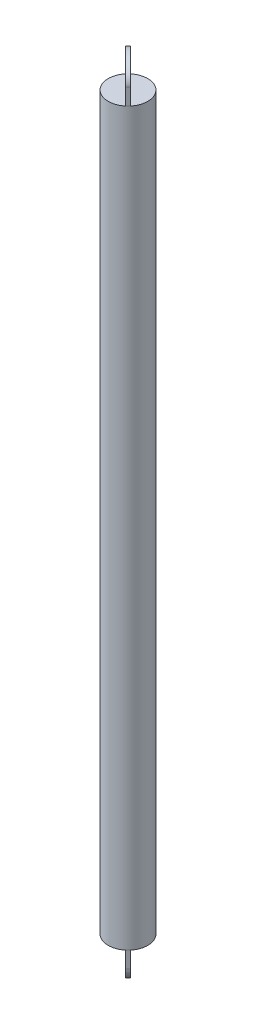
ISO-10303-21;
HEADER;
FILE_DESCRIPTION(('STEP AP214'),'2;1');
FILE_NAME('part.step','',(''),(''),'','','');
FILE_SCHEMA(('AUTOMOTIVE_DESIGN { 1 0 10303 214 1 1 1 1 }'));
ENDSEC;
DATA;
#1=APPLICATION_CONTEXT('core data for automotive mechanical design processes');
#2=APPLICATION_PROTOCOL_DEFINITION('international standard','automotive_design',2000,#1);
#3=PRODUCT_CONTEXT('',#1,'mechanical');
#4=PRODUCT('Part','Part','',(#3));
#5=PRODUCT_RELATED_PRODUCT_CATEGORY('part','',(#4));
#6=PRODUCT_DEFINITION_FORMATION('','',#4);
#7=PRODUCT_DEFINITION_CONTEXT('part definition',#1,'design');
#8=PRODUCT_DEFINITION('design','',#6,#7);
#9=PRODUCT_DEFINITION_SHAPE('','',#8);
#10=(LENGTH_UNIT() NAMED_UNIT(*) SI_UNIT(.MILLI.,.METRE.));
#11=(NAMED_UNIT(*) PLANE_ANGLE_UNIT() SI_UNIT($,.RADIAN.));
#12=(NAMED_UNIT(*) SI_UNIT($,.STERADIAN.) SOLID_ANGLE_UNIT());
#13=UNCERTAINTY_MEASURE_WITH_UNIT(LENGTH_MEASURE(1.E-05),#10,'distance_accuracy_value','');
#14=(GEOMETRIC_REPRESENTATION_CONTEXT(3) GLOBAL_UNCERTAINTY_ASSIGNED_CONTEXT((#13)) GLOBAL_UNIT_ASSIGNED_CONTEXT((#10,
#11,#12)) REPRESENTATION_CONTEXT('',''));
#15=CARTESIAN_POINT('',(0.,0.,0.));
#16=DIRECTION('',(0.,0.,1.));
#17=DIRECTION('',(1.,0.,0.));
#18=AXIS2_PLACEMENT_3D('',#15,#16,#17);
#19=CARTESIAN_POINT('',(0.,111.,0.));
#20=DIRECTION('',(0.,-1.,0.));
#21=DIRECTION('',(0.,0.,-1.));
#22=AXIS2_PLACEMENT_3D('',#19,#20,#21);
#23=CYLINDRICAL_SURFACE('',#22,6.);
#24=CARTESIAN_POINT('',(0.,0.,0.));
#25=DIRECTION('',(0.,1.,0.));
#26=DIRECTION('',(0.,0.,1.));
#27=AXIS2_PLACEMENT_3D('',#24,#25,#26);
#28=CIRCLE('',#27,6.);
#29=CARTESIAN_POINT('',(3.87433024072867,0.,4.58143702191521));
#30=VERTEX_POINT('',#29);
#31=CARTESIAN_POINT('',(4.24264068711929,0.,4.24264068711929));
#32=VERTEX_POINT('',#31);
#33=EDGE_CURVE('E291',#30,#32,#28,.T.);
#34=ORIENTED_EDGE('',*,*,#33,.T.);
#35=CARTESIAN_POINT('',(4.58143702191522,0.,3.87433024072867));
#36=VERTEX_POINT('',#35);
#37=EDGE_CURVE('E294',#32,#36,#28,.T.);
#38=ORIENTED_EDGE('',*,*,#37,.T.);
#39=CARTESIAN_POINT('',(-3.87433024072867,0.,-4.58143702191521));
#40=VERTEX_POINT('',#39);
#41=EDGE_CURVE('E432',#36,#40,#28,.T.);
#42=ORIENTED_EDGE('',*,*,#41,.T.);
#43=CARTESIAN_POINT('',(-4.24264068711929,0.,-4.24264068711929));
#44=VERTEX_POINT('',#43);
#45=EDGE_CURVE('E407',#40,#44,#28,.T.);
#46=ORIENTED_EDGE('',*,*,#45,.T.);
#47=CARTESIAN_POINT('',(-4.58143702191522,0.,-3.87433024072867));
#48=VERTEX_POINT('',#47);
#49=EDGE_CURVE('E402',#44,#48,#28,.T.);
#50=ORIENTED_EDGE('',*,*,#49,.T.);
#51=EDGE_CURVE('E272',#48,#30,#28,.T.);
#52=ORIENTED_EDGE('',*,*,#51,.T.);
#53=EDGE_LOOP('',(#34,#38,#42,#46,#50,#52));
#54=FACE_BOUND('',#53,.T.);
#55=CARTESIAN_POINT('',(0.,222.,0.));
#56=DIRECTION('',(0.,1.,0.));
#57=DIRECTION('',(0.,0.,1.));
#58=AXIS2_PLACEMENT_3D('',#55,#56,#57);
#59=CIRCLE('',#58,6.);
#60=CARTESIAN_POINT('',(3.87433024072867,222.,4.58143702191521));
#61=VERTEX_POINT('',#60);
#62=CARTESIAN_POINT('',(4.24264068711929,222.,4.24264068711929));
#63=VERTEX_POINT('',#62);
#64=EDGE_CURVE('E324',#61,#63,#59,.T.);
#65=ORIENTED_EDGE('',*,*,#64,.F.);
#66=CARTESIAN_POINT('',(-4.58143702191522,222.,-3.87433024072867));
#67=VERTEX_POINT('',#66);
#68=EDGE_CURVE('E308',#67,#61,#59,.T.);
#69=ORIENTED_EDGE('',*,*,#68,.F.);
#70=CARTESIAN_POINT('',(-4.24264068711929,222.,-4.24264068711929));
#71=VERTEX_POINT('',#70);
#72=EDGE_CURVE('E642',#71,#67,#59,.T.);
#73=ORIENTED_EDGE('',*,*,#72,.F.);
#74=CARTESIAN_POINT('',(-3.87433024072867,222.,-4.58143702191521));
#75=VERTEX_POINT('',#74);
#76=EDGE_CURVE('E303',#75,#71,#59,.T.);
#77=ORIENTED_EDGE('',*,*,#76,.F.);
#78=CARTESIAN_POINT('',(4.58143702191522,222.,3.87433024072867));
#79=VERTEX_POINT('',#78);
#80=EDGE_CURVE('E644',#79,#75,#59,.T.);
#81=ORIENTED_EDGE('',*,*,#80,.F.);
#82=EDGE_CURVE('E328',#63,#79,#59,.T.);
#83=ORIENTED_EDGE('',*,*,#82,.F.);
#84=EDGE_LOOP('',(#65,#69,#73,#77,#81,#83));
#85=FACE_BOUND('',#84,.T.);
#86=ADVANCED_FACE('F33',(#54,#85),#23,.T.);
#87=CARTESIAN_POINT('',(0.,0.,0.));
#88=DIRECTION('',(0.,1.,0.));
#89=DIRECTION('',(0.,0.,1.));
#90=AXIS2_PLACEMENT_3D('',#87,#88,#89);
#91=PLANE('',#90);
#92=ORIENTED_EDGE('',*,*,#51,.F.);
#93=DIRECTION('',(0.707106781186548,0.,0.707106781186547));
#94=VECTOR('',#93,1.);
#95=CARTESIAN_POINT('',(-0.353553390593274,0.,0.353553390593274));
#96=LINE('',#95,#94);
#97=CARTESIAN_POINT('',(-3.88908729652601,0.,-3.18198051533946));
#98=VERTEX_POINT('',#97);
#99=EDGE_CURVE('E297',#48,#98,#96,.T.);
#100=ORIENTED_EDGE('',*,*,#99,.T.);
#101=DIRECTION('',(0.707106781186547,0.,-0.707106781186548));
#102=VECTOR('',#101,1.);
#103=CARTESIAN_POINT('',(-3.88908729652601,0.,-3.18198051533946));
#104=LINE('',#103,#102);
#105=CARTESIAN_POINT('',(-3.18198051533946,0.,-3.88908729652601));
#106=VERTEX_POINT('',#105);
#107=EDGE_CURVE('E286',#98,#106,#104,.T.);
#108=ORIENTED_EDGE('',*,*,#107,.T.);
#109=DIRECTION('',(0.707106781186548,0.,0.707106781186547));
#110=VECTOR('',#109,1.);
#111=CARTESIAN_POINT('',(0.353553390593274,0.,-0.353553390593274));
#112=LINE('',#111,#110);
#113=EDGE_CURVE('E293',#40,#106,#112,.T.);
#114=ORIENTED_EDGE('',*,*,#113,.F.);
#115=ORIENTED_EDGE('',*,*,#41,.F.);
#116=DIRECTION('',(0.707106781186548,0.,0.707106781186547));
#117=VECTOR('',#116,1.);
#118=CARTESIAN_POINT('',(3.88908729652601,0.,3.18198051533946));
#119=LINE('',#118,#117);
#120=CARTESIAN_POINT('',(3.88908729652601,0.,3.18198051533946));
#121=VERTEX_POINT('',#120);
#122=EDGE_CURVE('E344',#121,#36,#119,.T.);
#123=ORIENTED_EDGE('',*,*,#122,.F.);
#124=DIRECTION('',(0.707106781186547,0.,-0.707106781186548));
#125=VECTOR('',#124,1.);
#126=CARTESIAN_POINT('',(3.18198051533946,0.,3.88908729652601));
#127=LINE('',#126,#125);
#128=CARTESIAN_POINT('',(3.18198051533946,0.,3.88908729652601));
#129=VERTEX_POINT('',#128);
#130=EDGE_CURVE('E279',#129,#121,#127,.T.);
#131=ORIENTED_EDGE('',*,*,#130,.F.);
#132=DIRECTION('',(0.707106781186548,0.,0.707106781186547));
#133=VECTOR('',#132,1.);
#134=CARTESIAN_POINT('',(3.18198051533946,0.,3.88908729652601));
#135=LINE('',#134,#133);
#136=EDGE_CURVE('E400',#129,#30,#135,.T.);
#137=ORIENTED_EDGE('',*,*,#136,.T.);
#138=EDGE_LOOP('',(#92,#100,#108,#114,#115,#123,#131,#137));
#139=FACE_BOUND('',#138,.T.);
#140=ADVANCED_FACE('F384',(#139),#91,.F.);
#141=CARTESIAN_POINT('',(3.18198051533946,0.,3.88908729652601));
#142=DIRECTION('',(0.,1.,0.));
#143=DIRECTION('',(-1.,0.,0.));
#144=AXIS2_PLACEMENT_3D('',#141,#142,#143);
#145=PLANE('',#144);
#146=ORIENTED_EDGE('',*,*,#33,.F.);
#147=CARTESIAN_POINT('',(3.88908729652601,0.,4.59619407771256));
#148=VERTEX_POINT('',#147);
#149=EDGE_CURVE('E424',#30,#148,#135,.T.);
#150=ORIENTED_EDGE('',*,*,#149,.T.);
#151=DIRECTION('',(0.707106781186547,0.,-0.707106781186548));
#152=VECTOR('',#151,1.);
#153=CARTESIAN_POINT('',(3.88908729652601,0.,4.59619407771256));
#154=LINE('',#153,#152);
#155=EDGE_CURVE('E275',#148,#32,#154,.T.);
#156=ORIENTED_EDGE('',*,*,#155,.T.);
#157=EDGE_LOOP('',(#146,#150,#156));
#158=FACE_BOUND('',#157,.T.);
#159=ADVANCED_FACE('F386',(#158),#145,.T.);
#160=CARTESIAN_POINT('',(-3.88908729652601,0.,-3.18198051533946));
#161=DIRECTION('',(0.,1.,0.));
#162=DIRECTION('',(0.,0.,1.));
#163=AXIS2_PLACEMENT_3D('',#160,#161,#162);
#164=PLANE('',#163);
#165=ORIENTED_EDGE('',*,*,#45,.F.);
#166=DIRECTION('',(0.707106781186548,0.,0.707106781186547));
#167=VECTOR('',#166,1.);
#168=CARTESIAN_POINT('',(-3.18198051533946,0.,-3.88908729652601));
#169=LINE('',#168,#167);
#170=CARTESIAN_POINT('',(-3.88908729652601,0.,-4.59619407771256));
#171=VERTEX_POINT('',#170);
#172=EDGE_CURVE('E331',#171,#40,#169,.T.);
#173=ORIENTED_EDGE('',*,*,#172,.F.);
#174=DIRECTION('',(0.707106781186547,0.,-0.707106781186548));
#175=VECTOR('',#174,1.);
#176=CARTESIAN_POINT('',(-4.59619407771256,0.,-3.88908729652601));
#177=LINE('',#176,#175);
#178=EDGE_CURVE('E267',#44,#171,#177,.T.);
#179=ORIENTED_EDGE('',*,*,#178,.F.);
#180=EDGE_LOOP('',(#165,#173,#179));
#181=FACE_BOUND('',#180,.T.);
#182=ADVANCED_FACE('F381',(#181),#164,.T.);
#183=CARTESIAN_POINT('',(-4.59619407771256,0.,-3.88908729652601));
#184=DIRECTION('',(-0.707106781186548,0.,-0.707106781186547));
#185=DIRECTION('',(-0.707106781186547,0.,0.707106781186548));
#186=AXIS2_PLACEMENT_3D('',#183,#184,#185);
#187=PLANE('',#186);
#188=CARTESIAN_POINT('',(-4.59619407771256,0.,-3.88908729652601));
#189=VERTEX_POINT('',#188);
#190=EDGE_CURVE('E288',#189,#44,#177,.T.);
#191=ORIENTED_EDGE('',*,*,#190,.T.);
#192=ORIENTED_EDGE('',*,*,#178,.T.);
#193=DIRECTION('',(0.,1.,0.));
#194=VECTOR('',#193,1.);
#195=CARTESIAN_POINT('',(-3.88908729652601,0.,-4.59619407771256));
#196=LINE('',#195,#194);
#197=CARTESIAN_POINT('',(-3.88908729652601,-5.,-4.59619407771256));
#198=VERTEX_POINT('',#197);
#199=EDGE_CURVE('E327',#198,#171,#196,.T.);
#200=ORIENTED_EDGE('',*,*,#199,.F.);
#201=DIRECTION('',(0.707106781186547,0.,-0.707106781186548));
#202=VECTOR('',#201,1.);
#203=CARTESIAN_POINT('',(-4.59619407771256,-5.,-3.88908729652601));
#204=LINE('',#203,#202);
#205=CARTESIAN_POINT('',(-4.59619407771256,-5.,-3.88908729652601));
#206=VERTEX_POINT('',#205);
#207=EDGE_CURVE('E270',#206,#198,#204,.T.);
#208=ORIENTED_EDGE('',*,*,#207,.F.);
#209=DIRECTION('',(0.,1.,0.));
#210=VECTOR('',#209,1.);
#211=CARTESIAN_POINT('',(-4.59619407771256,0.,-3.88908729652601));
#212=LINE('',#211,#210);
#213=EDGE_CURVE('E353',#206,#189,#212,.T.);
#214=ORIENTED_EDGE('',*,*,#213,.T.);
#215=EDGE_LOOP('',(#191,#192,#200,#208,#214));
#216=FACE_BOUND('',#215,.T.);
#217=ADVANCED_FACE('F259',(#216),#187,.T.);
#218=CARTESIAN_POINT('',(-0.353553390593273,-5.,0.353553390593275));
#219=DIRECTION('',(0.707106781186547,0.,-0.707106781186548));
#220=DIRECTION('',(-0.707106781186548,0.,-0.707106781186547));
#221=AXIS2_PLACEMENT_3D('',#218,#219,#220);
#222=ELLIPSE('',#221,6.,5.);
#223=DIRECTION('',(0.707106781186547,0.,-0.707106781186548));
#224=VECTOR('',#223,1.);
#225=SURFACE_OF_LINEAR_EXTRUSION('',#222,#224);
#226=ORIENTED_EDGE('',*,*,#207,.T.);
#227=CARTESIAN_POINT('',(0.353553390593275,-5.,-0.353553390593273));
#228=DIRECTION('',(0.707106781186547,0.,-0.707106781186548));
#229=DIRECTION('',(-0.707106781186548,0.,-0.707106781186547));
#230=AXIS2_PLACEMENT_3D('',#227,#228,#229);
#231=ELLIPSE('',#230,6.,5.);
#232=CARTESIAN_POINT('',(4.59619407771256,-5.,3.88908729652601));
#233=VERTEX_POINT('',#232);
#234=EDGE_CURVE('E350',#233,#198,#231,.T.);
#235=ORIENTED_EDGE('',*,*,#234,.F.);
#236=DIRECTION('',(0.707106781186547,0.,-0.707106781186548));
#237=VECTOR('',#236,1.);
#238=CARTESIAN_POINT('',(3.88908729652601,-5.,4.59619407771256));
#239=LINE('',#238,#237);
#240=CARTESIAN_POINT('',(3.88908729652601,-5.,4.59619407771256));
#241=VERTEX_POINT('',#240);
#242=EDGE_CURVE('E273',#241,#233,#239,.T.);
#243=ORIENTED_EDGE('',*,*,#242,.F.);
#244=EDGE_CURVE('E262',#241,#206,#222,.T.);
#245=ORIENTED_EDGE('',*,*,#244,.T.);
#246=EDGE_LOOP('',(#226,#235,#243,#245));
#247=FACE_BOUND('',#246,.T.);
#248=ADVANCED_FACE('F254',(#247),#225,.T.);
#249=CARTESIAN_POINT('',(3.88908729652601,0.,4.59619407771256));
#250=DIRECTION('',(0.707106781186548,0.,0.707106781186547));
#251=DIRECTION('',(0.707106781186547,0.,-0.707106781186548));
#252=AXIS2_PLACEMENT_3D('',#249,#250,#251);
#253=PLANE('',#252);
#254=ORIENTED_EDGE('',*,*,#242,.T.);
#255=DIRECTION('',(0.,-1.,0.));
#256=VECTOR('',#255,1.);
#257=CARTESIAN_POINT('',(4.59619407771256,0.,3.88908729652601));
#258=LINE('',#257,#256);
#259=CARTESIAN_POINT('',(4.59619407771256,0.,3.88908729652601));
#260=VERTEX_POINT('',#259);
#261=EDGE_CURVE('E347',#260,#233,#258,.T.);
#262=ORIENTED_EDGE('',*,*,#261,.F.);
#263=EDGE_CURVE('E278',#32,#260,#154,.T.);
#264=ORIENTED_EDGE('',*,*,#263,.F.);
#265=ORIENTED_EDGE('',*,*,#155,.F.);
#266=DIRECTION('',(0.,-1.,0.));
#267=VECTOR('',#266,1.);
#268=CARTESIAN_POINT('',(3.88908729652601,0.,4.59619407771256));
#269=LINE('',#268,#267);
#270=EDGE_CURVE('E268',#148,#241,#269,.T.);
#271=ORIENTED_EDGE('',*,*,#270,.T.);
#272=EDGE_LOOP('',(#254,#262,#264,#265,#271));
#273=FACE_BOUND('',#272,.T.);
#274=ADVANCED_FACE('F258',(#273),#253,.T.);
#275=ORIENTED_EDGE('',*,*,#37,.F.);
#276=ORIENTED_EDGE('',*,*,#263,.T.);
#277=EDGE_CURVE('E343',#36,#260,#119,.T.);
#278=ORIENTED_EDGE('',*,*,#277,.F.);
#279=EDGE_LOOP('',(#275,#276,#278));
#280=FACE_BOUND('',#279,.T.);
#281=ADVANCED_FACE('F393',(#280),#145,.T.);
#282=CARTESIAN_POINT('',(3.18198051533946,-5.00000000000002,3.88908729652601));
#283=DIRECTION('',(-0.707106781186548,0.,-0.707106781186547));
#284=DIRECTION('',(-0.707106781186547,0.,0.707106781186548));
#285=AXIS2_PLACEMENT_3D('',#282,#283,#284);
#286=PLANE('',#285);
#287=ORIENTED_EDGE('',*,*,#130,.T.);
#288=DIRECTION('',(0.,1.,0.));
#289=VECTOR('',#288,1.);
#290=CARTESIAN_POINT('',(3.88908729652601,-5.00000000000002,3.18198051533946));
#291=LINE('',#290,#289);
#292=CARTESIAN_POINT('',(3.88908729652601,-5.00000000000002,3.18198051533947));
#293=VERTEX_POINT('',#292);
#294=EDGE_CURVE('E340',#293,#121,#291,.T.);
#295=ORIENTED_EDGE('',*,*,#294,.F.);
#296=DIRECTION('',(0.707106781186547,0.,-0.707106781186548));
#297=VECTOR('',#296,1.);
#298=CARTESIAN_POINT('',(3.18198051533947,-5.00000000000002,3.88908729652601));
#299=LINE('',#298,#297);
#300=CARTESIAN_POINT('',(3.18198051533947,-5.00000000000002,3.88908729652601));
#301=VERTEX_POINT('',#300);
#302=EDGE_CURVE('E282',#301,#293,#299,.T.);
#303=ORIENTED_EDGE('',*,*,#302,.F.);
#304=DIRECTION('',(0.,1.,0.));
#305=VECTOR('',#304,1.);
#306=CARTESIAN_POINT('',(3.18198051533946,-5.00000000000002,3.88908729652601));
#307=LINE('',#306,#305);
#308=EDGE_CURVE('E366',#301,#129,#307,.T.);
#309=ORIENTED_EDGE('',*,*,#308,.T.);
#310=EDGE_LOOP('',(#287,#295,#303,#309));
#311=FACE_BOUND('',#310,.T.);
#312=ADVANCED_FACE('F373',(#311),#286,.T.);
#313=CARTESIAN_POINT('',(-0.353553390593273,-5.,0.353553390593275));
#314=DIRECTION('',(-0.707106781186547,0.,0.707106781186548));
#315=DIRECTION('',(-0.707106781186548,0.,-0.707106781186547));
#316=AXIS2_PLACEMENT_3D('',#313,#314,#315);
#317=ELLIPSE('',#316,5.,4.00000000000011);
#318=DIRECTION('',(0.707106781186547,0.,-0.707106781186548));
#319=VECTOR('',#318,1.);
#320=SURFACE_OF_LINEAR_EXTRUSION('',#317,#319);
#321=ORIENTED_EDGE('',*,*,#302,.T.);
#322=CARTESIAN_POINT('',(0.353553390593275,-5.,-0.353553390593273));
#323=DIRECTION('',(-0.707106781186547,0.,0.707106781186548));
#324=DIRECTION('',(-0.707106781186548,0.,-0.707106781186547));
#325=AXIS2_PLACEMENT_3D('',#322,#323,#324);
#326=ELLIPSE('',#325,5.,4.00000000000011);
#327=CARTESIAN_POINT('',(-3.18198051533946,-5.00000000000002,-3.88908729652601));
#328=VERTEX_POINT('',#327);
#329=EDGE_CURVE('E337',#328,#293,#326,.T.);
#330=ORIENTED_EDGE('',*,*,#329,.F.);
#331=DIRECTION('',(0.707106781186547,0.,-0.707106781186548));
#332=VECTOR('',#331,1.);
#333=CARTESIAN_POINT('',(-3.88908729652601,-5.00000000000002,-3.18198051533946));
#334=LINE('',#333,#332);
#335=CARTESIAN_POINT('',(-3.88908729652601,-5.00000000000002,-3.18198051533946));
#336=VERTEX_POINT('',#335);
#337=EDGE_CURVE('E284',#336,#328,#334,.T.);
#338=ORIENTED_EDGE('',*,*,#337,.F.);
#339=EDGE_CURVE('E362',#336,#301,#317,.T.);
#340=ORIENTED_EDGE('',*,*,#339,.T.);
#341=EDGE_LOOP('',(#321,#330,#338,#340));
#342=FACE_BOUND('',#341,.T.);
#343=ADVANCED_FACE('F368',(#342),#320,.T.);
#344=CARTESIAN_POINT('',(-3.88908729652601,-5.00000000000002,-3.18198051533946));
#345=DIRECTION('',(0.707106781186548,0.,0.707106781186547));
#346=DIRECTION('',(0.707106781186547,0.,-0.707106781186548));
#347=AXIS2_PLACEMENT_3D('',#344,#345,#346);
#348=PLANE('',#347);
#349=ORIENTED_EDGE('',*,*,#337,.T.);
#350=DIRECTION('',(0.,-1.,0.));
#351=VECTOR('',#350,1.);
#352=CARTESIAN_POINT('',(-3.18198051533946,-5.00000000000002,-3.88908729652601));
#353=LINE('',#352,#351);
#354=EDGE_CURVE('E334',#106,#328,#353,.T.);
#355=ORIENTED_EDGE('',*,*,#354,.F.);
#356=ORIENTED_EDGE('',*,*,#107,.F.);
#357=DIRECTION('',(0.,-1.,0.));
#358=VECTOR('',#357,1.);
#359=CARTESIAN_POINT('',(-3.88908729652601,-5.00000000000002,-3.18198051533946));
#360=LINE('',#359,#358);
#361=EDGE_CURVE('E359',#98,#336,#360,.T.);
#362=ORIENTED_EDGE('',*,*,#361,.T.);
#363=EDGE_LOOP('',(#349,#355,#356,#362));
#364=FACE_BOUND('',#363,.T.);
#365=ADVANCED_FACE('F372',(#364),#348,.T.);
#366=ORIENTED_EDGE('',*,*,#49,.F.);
#367=ORIENTED_EDGE('',*,*,#190,.F.);
#368=DIRECTION('',(0.707106781186548,0.,0.707106781186547));
#369=VECTOR('',#368,1.);
#370=CARTESIAN_POINT('',(-3.88908729652601,0.,-3.18198051533946));
#371=LINE('',#370,#369);
#372=EDGE_CURVE('E356',#189,#48,#371,.T.);
#373=ORIENTED_EDGE('',*,*,#372,.T.);
#374=EDGE_LOOP('',(#366,#367,#373));
#375=FACE_BOUND('',#374,.T.);
#376=ADVANCED_FACE('F252',(#375),#164,.T.);
#377=CARTESIAN_POINT('',(-0.353553390593273,-5.,0.353553390593275));
#378=DIRECTION('',(-0.707106781186547,0.,0.707106781186548));
#379=DIRECTION('',(0.707106781186548,0.,0.707106781186547));
#380=AXIS2_PLACEMENT_3D('',#377,#378,#379);
#381=PLANE('',#380);
#382=ORIENTED_EDGE('',*,*,#213,.F.);
#383=ORIENTED_EDGE('',*,*,#244,.F.);
#384=ORIENTED_EDGE('',*,*,#270,.F.);
#385=ORIENTED_EDGE('',*,*,#149,.F.);
#386=ORIENTED_EDGE('',*,*,#136,.F.);
#387=ORIENTED_EDGE('',*,*,#308,.F.);
#388=ORIENTED_EDGE('',*,*,#339,.F.);
#389=ORIENTED_EDGE('',*,*,#361,.F.);
#390=ORIENTED_EDGE('',*,*,#99,.F.);
#391=ORIENTED_EDGE('',*,*,#372,.F.);
#392=EDGE_LOOP('',(#382,#383,#384,#385,#386,#387,#388,#389,#390,#391));
#393=FACE_BOUND('',#392,.T.);
#394=ADVANCED_FACE('F248',(#393),#381,.T.);
#395=CARTESIAN_POINT('',(0.353553390593275,-5.,-0.353553390593273));
#396=DIRECTION('',(-0.707106781186547,0.,0.707106781186548));
#397=DIRECTION('',(0.707106781186548,0.,0.707106781186547));
#398=AXIS2_PLACEMENT_3D('',#395,#396,#397);
#399=PLANE('',#398);
#400=ORIENTED_EDGE('',*,*,#199,.T.);
#401=ORIENTED_EDGE('',*,*,#172,.T.);
#402=ORIENTED_EDGE('',*,*,#113,.T.);
#403=ORIENTED_EDGE('',*,*,#354,.T.);
#404=ORIENTED_EDGE('',*,*,#329,.T.);
#405=ORIENTED_EDGE('',*,*,#294,.T.);
#406=ORIENTED_EDGE('',*,*,#122,.T.);
#407=ORIENTED_EDGE('',*,*,#277,.T.);
#408=ORIENTED_EDGE('',*,*,#261,.T.);
#409=ORIENTED_EDGE('',*,*,#234,.T.);
#410=EDGE_LOOP('',(#400,#401,#402,#403,#404,#405,#406,#407,#408,#409));
#411=FACE_BOUND('',#410,.T.);
#412=ADVANCED_FACE('F245',(#411),#399,.F.);
#413=CARTESIAN_POINT('',(0.,222.,0.));
#414=DIRECTION('',(0.,-1.,0.));
#415=DIRECTION('',(0.,0.,1.));
#416=AXIS2_PLACEMENT_3D('',#413,#414,#415);
#417=PLANE('',#416);
#418=ORIENTED_EDGE('',*,*,#68,.T.);
#419=DIRECTION('',(0.707106781186548,0.,0.707106781186547));
#420=VECTOR('',#419,1.);
#421=CARTESIAN_POINT('',(3.18198051533946,222.,3.88908729652601));
#422=LINE('',#421,#420);
#423=CARTESIAN_POINT('',(3.18198051533946,222.,3.88908729652601));
#424=VERTEX_POINT('',#423);
#425=EDGE_CURVE('E47',#424,#61,#422,.T.);
#426=ORIENTED_EDGE('',*,*,#425,.F.);
#427=DIRECTION('',(0.707106781186547,0.,-0.707106781186548));
#428=VECTOR('',#427,1.);
#429=CARTESIAN_POINT('',(3.18198051533946,222.,3.88908729652601));
#430=LINE('',#429,#428);
#431=CARTESIAN_POINT('',(3.88908729652601,222.,3.18198051533946));
#432=VERTEX_POINT('',#431);
#433=EDGE_CURVE('E317',#424,#432,#430,.T.);
#434=ORIENTED_EDGE('',*,*,#433,.T.);
#435=DIRECTION('',(0.707106781186548,0.,0.707106781186547));
#436=VECTOR('',#435,1.);
#437=CARTESIAN_POINT('',(3.88908729652601,222.,3.18198051533946));
#438=LINE('',#437,#436);
#439=EDGE_CURVE('E212',#432,#79,#438,.T.);
#440=ORIENTED_EDGE('',*,*,#439,.T.);
#441=ORIENTED_EDGE('',*,*,#80,.T.);
#442=DIRECTION('',(-0.707106781186548,0.,-0.707106781186547));
#443=VECTOR('',#442,1.);
#444=CARTESIAN_POINT('',(0.353553390593274,222.,-0.353553390593274));
#445=LINE('',#444,#443);
#446=CARTESIAN_POINT('',(-3.18198051533946,222.,-3.88908729652601));
#447=VERTEX_POINT('',#446);
#448=EDGE_CURVE('E40',#447,#75,#445,.T.);
#449=ORIENTED_EDGE('',*,*,#448,.F.);
#450=DIRECTION('',(0.707106781186547,0.,-0.707106781186548));
#451=VECTOR('',#450,1.);
#452=CARTESIAN_POINT('',(-3.88908729652601,222.,-3.18198051533946));
#453=LINE('',#452,#451);
#454=CARTESIAN_POINT('',(-3.88908729652601,222.,-3.18198051533946));
#455=VERTEX_POINT('',#454);
#456=EDGE_CURVE('E53',#455,#447,#453,.T.);
#457=ORIENTED_EDGE('',*,*,#456,.F.);
#458=DIRECTION('',(-0.707106781186548,0.,-0.707106781186547));
#459=VECTOR('',#458,1.);
#460=CARTESIAN_POINT('',(-0.353553390593274,222.,0.353553390593274));
#461=LINE('',#460,#459);
#462=EDGE_CURVE('E11',#455,#67,#461,.T.);
#463=ORIENTED_EDGE('',*,*,#462,.T.);
#464=EDGE_LOOP('',(#418,#426,#434,#440,#441,#449,#457,#463));
#465=FACE_BOUND('',#464,.T.);
#466=ADVANCED_FACE('F241',(#465),#417,.F.);
#467=CARTESIAN_POINT('',(-3.88908729652601,222.,-3.18198051533946));
#468=DIRECTION('',(0.,1.,0.));
#469=DIRECTION('',(0.,0.,1.));
#470=AXIS2_PLACEMENT_3D('',#467,#468,#469);
#471=PLANE('',#470);
#472=DIRECTION('',(0.707106781186548,0.,0.707106781186547));
#473=VECTOR('',#472,1.);
#474=CARTESIAN_POINT('',(-3.18198051533946,222.,-3.88908729652601));
#475=LINE('',#474,#473);
#476=CARTESIAN_POINT('',(-3.88908729652601,222.,-4.59619407771256));
#477=VERTEX_POINT('',#476);
#478=EDGE_CURVE('E203',#477,#75,#475,.T.);
#479=ORIENTED_EDGE('',*,*,#478,.T.);
#480=ORIENTED_EDGE('',*,*,#76,.T.);
#481=DIRECTION('',(0.707106781186547,0.,-0.707106781186548));
#482=VECTOR('',#481,1.);
#483=CARTESIAN_POINT('',(-4.59619407771256,222.,-3.88908729652601));
#484=LINE('',#483,#482);
#485=EDGE_CURVE('E304',#71,#477,#484,.T.);
#486=ORIENTED_EDGE('',*,*,#485,.T.);
#487=EDGE_LOOP('',(#479,#480,#486));
#488=FACE_BOUND('',#487,.T.);
#489=ADVANCED_FACE('F244',(#488),#471,.F.);
#490=CARTESIAN_POINT('',(3.18198051533946,222.,3.88908729652601));
#491=DIRECTION('',(0.,1.,0.));
#492=DIRECTION('',(-1.,0.,0.));
#493=AXIS2_PLACEMENT_3D('',#490,#491,#492);
#494=PLANE('',#493);
#495=CARTESIAN_POINT('',(3.88908729652601,222.,4.59619407771256));
#496=VERTEX_POINT('',#495);
#497=EDGE_CURVE('E651',#61,#496,#422,.T.);
#498=ORIENTED_EDGE('',*,*,#497,.F.);
#499=ORIENTED_EDGE('',*,*,#64,.T.);
#500=DIRECTION('',(0.707106781186547,0.,-0.707106781186548));
#501=VECTOR('',#500,1.);
#502=CARTESIAN_POINT('',(3.88908729652601,222.,4.59619407771256));
#503=LINE('',#502,#501);
#504=EDGE_CURVE('E319',#496,#63,#503,.T.);
#505=ORIENTED_EDGE('',*,*,#504,.F.);
#506=EDGE_LOOP('',(#498,#499,#505));
#507=FACE_BOUND('',#506,.T.);
#508=ADVANCED_FACE('F240',(#507),#494,.F.);
#509=CARTESIAN_POINT('',(-4.59619407771256,222.,-3.88908729652601));
#510=DIRECTION('',(0.707106781186548,0.,0.707106781186547));
#511=DIRECTION('',(0.707106781186547,0.,-0.707106781186548));
#512=AXIS2_PLACEMENT_3D('',#509,#510,#511);
#513=PLANE('',#512);
#514=DIRECTION('',(0.707106781186547,0.,-0.707106781186548));
#515=VECTOR('',#514,1.);
#516=CARTESIAN_POINT('',(-4.59619407771256,227.,-3.88908729652601));
#517=LINE('',#516,#515);
#518=CARTESIAN_POINT('',(-4.59619407771256,227.,-3.88908729652601));
#519=VERTEX_POINT('',#518);
#520=CARTESIAN_POINT('',(-3.88908729652601,227.,-4.59619407771256));
#521=VERTEX_POINT('',#520);
#522=EDGE_CURVE('E180',#519,#521,#517,.T.);
#523=ORIENTED_EDGE('',*,*,#522,.T.);
#524=DIRECTION('',(0.,-1.,0.));
#525=VECTOR('',#524,1.);
#526=CARTESIAN_POINT('',(-3.88908729652601,222.,-4.59619407771256));
#527=LINE('',#526,#525);
#528=EDGE_CURVE('E184',#521,#477,#527,.T.);
#529=ORIENTED_EDGE('',*,*,#528,.T.);
#530=ORIENTED_EDGE('',*,*,#485,.F.);
#531=CARTESIAN_POINT('',(-4.59619407771256,222.,-3.88908729652601));
#532=VERTEX_POINT('',#531);
#533=EDGE_CURVE('E306',#532,#71,#484,.T.);
#534=ORIENTED_EDGE('',*,*,#533,.F.);
#535=DIRECTION('',(0.,-1.,0.));
#536=VECTOR('',#535,1.);
#537=CARTESIAN_POINT('',(-4.59619407771256,222.,-3.88908729652601));
#538=LINE('',#537,#536);
#539=EDGE_CURVE('E188',#519,#532,#538,.T.);
#540=ORIENTED_EDGE('',*,*,#539,.F.);
#541=EDGE_LOOP('',(#523,#529,#530,#534,#540));
#542=FACE_BOUND('',#541,.T.);
#543=ADVANCED_FACE('F182',(#542),#513,.F.);
#544=ORIENTED_EDGE('',*,*,#533,.T.);
#545=ORIENTED_EDGE('',*,*,#72,.T.);
#546=DIRECTION('',(0.707106781186548,0.,0.707106781186547));
#547=VECTOR('',#546,1.);
#548=CARTESIAN_POINT('',(-3.88908729652601,222.,-3.18198051533946));
#549=LINE('',#548,#547);
#550=EDGE_CURVE('E193',#532,#67,#549,.T.);
#551=ORIENTED_EDGE('',*,*,#550,.F.);
#552=EDGE_LOOP('',(#544,#545,#551));
#553=FACE_BOUND('',#552,.T.);
#554=ADVANCED_FACE('F239',(#553),#471,.F.);
#555=CARTESIAN_POINT('',(-3.88908729652601,227.,-3.18198051533946));
#556=DIRECTION('',(-0.707106781186548,0.,-0.707106781186547));
#557=DIRECTION('',(-0.707106781186547,0.,0.707106781186548));
#558=AXIS2_PLACEMENT_3D('',#555,#556,#557);
#559=PLANE('',#558);
#560=ORIENTED_EDGE('',*,*,#456,.T.);
#561=DIRECTION('',(0.,1.,0.));
#562=VECTOR('',#561,1.);
#563=CARTESIAN_POINT('',(-3.18198051533946,227.,-3.88908729652601));
#564=LINE('',#563,#562);
#565=CARTESIAN_POINT('',(-3.18198051533946,227.,-3.88908729652601));
#566=VERTEX_POINT('',#565);
#567=EDGE_CURVE('E220',#447,#566,#564,.T.);
#568=ORIENTED_EDGE('',*,*,#567,.T.);
#569=DIRECTION('',(0.707106781186547,0.,-0.707106781186548));
#570=VECTOR('',#569,1.);
#571=CARTESIAN_POINT('',(-3.88908729652601,227.,-3.18198051533946));
#572=LINE('',#571,#570);
#573=CARTESIAN_POINT('',(-3.88908729652601,227.,-3.18198051533946));
#574=VERTEX_POINT('',#573);
#575=EDGE_CURVE('E309',#574,#566,#572,.T.);
#576=ORIENTED_EDGE('',*,*,#575,.F.);
#577=DIRECTION('',(0.,1.,0.));
#578=VECTOR('',#577,1.);
#579=CARTESIAN_POINT('',(-3.88908729652601,227.,-3.18198051533946));
#580=LINE('',#579,#578);
#581=EDGE_CURVE('E636',#455,#574,#580,.T.);
#582=ORIENTED_EDGE('',*,*,#581,.F.);
#583=EDGE_LOOP('',(#560,#568,#576,#582));
#584=FACE_BOUND('',#583,.T.);
#585=ADVANCED_FACE('F514',(#584),#559,.F.);
#586=CARTESIAN_POINT('',(-0.353553390593273,227.,0.353553390593275));
#587=DIRECTION('',(0.707106781186547,0.,-0.707106781186548));
#588=DIRECTION('',(-0.707106781186548,0.,-0.707106781186547));
#589=AXIS2_PLACEMENT_3D('',#586,#587,#588);
#590=ELLIPSE('',#589,5.,4.00000000000011);
#591=DIRECTION('',(0.707106781186547,0.,-0.707106781186548));
#592=VECTOR('',#591,1.);
#593=SURFACE_OF_LINEAR_EXTRUSION('',#590,#592);
#594=ORIENTED_EDGE('',*,*,#575,.T.);
#595=CARTESIAN_POINT('',(0.353553390593275,227.,-0.353553390593273));
#596=DIRECTION('',(0.707106781186547,0.,-0.707106781186548));
#597=DIRECTION('',(-0.707106781186548,0.,-0.707106781186547));
#598=AXIS2_PLACEMENT_3D('',#595,#596,#597);
#599=ELLIPSE('',#598,5.,4.00000000000011);
#600=CARTESIAN_POINT('',(3.88908729652601,227.,3.18198051533947));
#601=VERTEX_POINT('',#600);
#602=EDGE_CURVE('E217',#566,#601,#599,.T.);
#603=ORIENTED_EDGE('',*,*,#602,.T.);
#604=DIRECTION('',(0.707106781186547,0.,-0.707106781186548));
#605=VECTOR('',#604,1.);
#606=CARTESIAN_POINT('',(3.18198051533947,227.,3.88908729652601));
#607=LINE('',#606,#605);
#608=CARTESIAN_POINT('',(3.18198051533947,227.,3.88908729652601));
#609=VERTEX_POINT('',#608);
#610=EDGE_CURVE('E315',#609,#601,#607,.T.);
#611=ORIENTED_EDGE('',*,*,#610,.F.);
#612=EDGE_CURVE('E633',#574,#609,#590,.T.);
#613=ORIENTED_EDGE('',*,*,#612,.F.);
#614=EDGE_LOOP('',(#594,#603,#611,#613));
#615=FACE_BOUND('',#614,.T.);
#616=ADVANCED_FACE('F522',(#615),#593,.F.);
#617=CARTESIAN_POINT('',(3.18198051533946,227.,3.88908729652601));
#618=DIRECTION('',(0.707106781186548,0.,0.707106781186547));
#619=DIRECTION('',(0.707106781186547,0.,-0.707106781186548));
#620=AXIS2_PLACEMENT_3D('',#617,#618,#619);
#621=PLANE('',#620);
#622=ORIENTED_EDGE('',*,*,#610,.T.);
#623=DIRECTION('',(0.,-1.,0.));
#624=VECTOR('',#623,1.);
#625=CARTESIAN_POINT('',(3.88908729652601,227.,3.18198051533946));
#626=LINE('',#625,#624);
#627=EDGE_CURVE('E214',#601,#432,#626,.T.);
#628=ORIENTED_EDGE('',*,*,#627,.T.);
#629=ORIENTED_EDGE('',*,*,#433,.F.);
#630=DIRECTION('',(0.,-1.,0.));
#631=VECTOR('',#630,1.);
#632=CARTESIAN_POINT('',(3.18198051533946,227.,3.88908729652601));
#633=LINE('',#632,#631);
#634=EDGE_CURVE('E637',#609,#424,#633,.T.);
#635=ORIENTED_EDGE('',*,*,#634,.F.);
#636=EDGE_LOOP('',(#622,#628,#629,#635));
#637=FACE_BOUND('',#636,.T.);
#638=ADVANCED_FACE('F531',(#637),#621,.F.);
#639=CARTESIAN_POINT('',(4.59619407771256,222.,3.88908729652601));
#640=VERTEX_POINT('',#639);
#641=EDGE_CURVE('E322',#63,#640,#503,.T.);
#642=ORIENTED_EDGE('',*,*,#641,.F.);
#643=ORIENTED_EDGE('',*,*,#82,.T.);
#644=EDGE_CURVE('E209',#79,#640,#438,.T.);
#645=ORIENTED_EDGE('',*,*,#644,.T.);
#646=EDGE_LOOP('',(#642,#643,#645));
#647=FACE_BOUND('',#646,.T.);
#648=ADVANCED_FACE('F502',(#647),#494,.F.);
#649=CARTESIAN_POINT('',(3.88908729652601,222.,4.59619407771256));
#650=DIRECTION('',(-0.707106781186548,0.,-0.707106781186547));
#651=DIRECTION('',(-0.707106781186547,0.,0.707106781186548));
#652=AXIS2_PLACEMENT_3D('',#649,#650,#651);
#653=PLANE('',#652);
#654=ORIENTED_EDGE('',*,*,#504,.T.);
#655=ORIENTED_EDGE('',*,*,#641,.T.);
#656=DIRECTION('',(0.,1.,0.));
#657=VECTOR('',#656,1.);
#658=CARTESIAN_POINT('',(4.59619407771256,222.,3.88908729652601));
#659=LINE('',#658,#657);
#660=CARTESIAN_POINT('',(4.59619407771256,227.,3.88908729652601));
#661=VERTEX_POINT('',#660);
#662=EDGE_CURVE('E207',#640,#661,#659,.T.);
#663=ORIENTED_EDGE('',*,*,#662,.T.);
#664=DIRECTION('',(0.707106781186547,0.,-0.707106781186548));
#665=VECTOR('',#664,1.);
#666=CARTESIAN_POINT('',(3.88908729652601,227.,4.59619407771256));
#667=LINE('',#666,#665);
#668=CARTESIAN_POINT('',(3.88908729652601,227.,4.59619407771256));
#669=VERTEX_POINT('',#668);
#670=EDGE_CURVE('E192',#669,#661,#667,.T.);
#671=ORIENTED_EDGE('',*,*,#670,.F.);
#672=DIRECTION('',(0.,1.,0.));
#673=VECTOR('',#672,1.);
#674=CARTESIAN_POINT('',(3.88908729652601,222.,4.59619407771256));
#675=LINE('',#674,#673);
#676=EDGE_CURVE('E228',#496,#669,#675,.T.);
#677=ORIENTED_EDGE('',*,*,#676,.F.);
#678=EDGE_LOOP('',(#654,#655,#663,#671,#677));
#679=FACE_BOUND('',#678,.T.);
#680=ADVANCED_FACE('F235',(#679),#653,.F.);
#681=CARTESIAN_POINT('',(-0.353553390593273,227.,0.353553390593275));
#682=DIRECTION('',(-0.707106781186547,0.,0.707106781186548));
#683=DIRECTION('',(-0.707106781186548,0.,-0.707106781186547));
#684=AXIS2_PLACEMENT_3D('',#681,#682,#683);
#685=ELLIPSE('',#684,6.,5.);
#686=DIRECTION('',(0.707106781186547,0.,-0.707106781186548));
#687=VECTOR('',#686,1.);
#688=SURFACE_OF_LINEAR_EXTRUSION('',#685,#687);
#689=ORIENTED_EDGE('',*,*,#670,.T.);
#690=CARTESIAN_POINT('',(0.353553390593275,227.,-0.353553390593273));
#691=DIRECTION('',(-0.707106781186547,0.,0.707106781186548));
#692=DIRECTION('',(-0.707106781186548,0.,-0.707106781186547));
#693=AXIS2_PLACEMENT_3D('',#690,#691,#692);
#694=ELLIPSE('',#693,6.,5.);
#695=EDGE_CURVE('E199',#661,#521,#694,.T.);
#696=ORIENTED_EDGE('',*,*,#695,.T.);
#697=ORIENTED_EDGE('',*,*,#522,.F.);
#698=EDGE_CURVE('E225',#669,#519,#685,.T.);
#699=ORIENTED_EDGE('',*,*,#698,.F.);
#700=EDGE_LOOP('',(#689,#696,#697,#699));
#701=FACE_BOUND('',#700,.T.);
#702=ADVANCED_FACE('F205',(#701),#688,.F.);
#703=CARTESIAN_POINT('',(-0.353553390593273,227.,0.353553390593275));
#704=DIRECTION('',(-0.707106781186547,0.,0.707106781186548));
#705=DIRECTION('',(0.707106781186548,0.,0.707106781186547));
#706=AXIS2_PLACEMENT_3D('',#703,#704,#705);
#707=PLANE('',#706);
#708=ORIENTED_EDGE('',*,*,#539,.T.);
#709=ORIENTED_EDGE('',*,*,#550,.T.);
#710=ORIENTED_EDGE('',*,*,#462,.F.);
#711=ORIENTED_EDGE('',*,*,#581,.T.);
#712=ORIENTED_EDGE('',*,*,#612,.T.);
#713=ORIENTED_EDGE('',*,*,#634,.T.);
#714=ORIENTED_EDGE('',*,*,#425,.T.);
#715=ORIENTED_EDGE('',*,*,#497,.T.);
#716=ORIENTED_EDGE('',*,*,#676,.T.);
#717=ORIENTED_EDGE('',*,*,#698,.T.);
#718=EDGE_LOOP('',(#708,#709,#710,#711,#712,#713,#714,#715,#716,#717));
#719=FACE_BOUND('',#718,.T.);
#720=ADVANCED_FACE('F234',(#719),#707,.T.);
#721=CARTESIAN_POINT('',(0.353553390593275,227.,-0.353553390593273));
#722=DIRECTION('',(-0.707106781186547,0.,0.707106781186548));
#723=DIRECTION('',(0.707106781186548,0.,0.707106781186547));
#724=AXIS2_PLACEMENT_3D('',#721,#722,#723);
#725=PLANE('',#724);
#726=ORIENTED_EDGE('',*,*,#528,.F.);
#727=ORIENTED_EDGE('',*,*,#695,.F.);
#728=ORIENTED_EDGE('',*,*,#662,.F.);
#729=ORIENTED_EDGE('',*,*,#644,.F.);
#730=ORIENTED_EDGE('',*,*,#439,.F.);
#731=ORIENTED_EDGE('',*,*,#627,.F.);
#732=ORIENTED_EDGE('',*,*,#602,.F.);
#733=ORIENTED_EDGE('',*,*,#567,.F.);
#734=ORIENTED_EDGE('',*,*,#448,.T.);
#735=ORIENTED_EDGE('',*,*,#478,.F.);
#736=EDGE_LOOP('',(#726,#727,#728,#729,#730,#731,#732,#733,#734,#735));
#737=FACE_BOUND('',#736,.T.);
#738=ADVANCED_FACE('F197',(#737),#725,.F.);
#739=CLOSED_SHELL('',(#86,#140,#159,#182,#217,#248,#274,#281,#312,#343,#365,#376,#394,#412,#466,
#489,#508,#543,#554,#585,#616,#638,#648,#680,#702,#720,#738));
#740=MANIFOLD_SOLID_BREP('B2',#739);
#741=ADVANCED_BREP_SHAPE_REPRESENTATION('',(#18,#740),#14);
#742=SHAPE_DEFINITION_REPRESENTATION(#9,#741);
ENDSEC;
END-ISO-10303-21;
